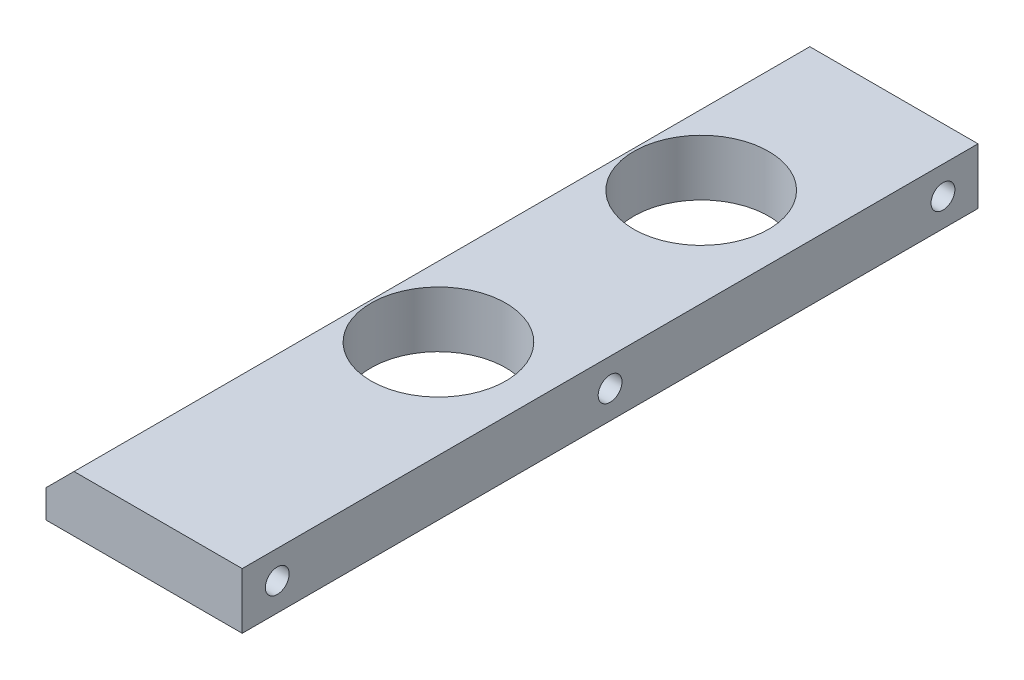
ISO-10303-21;
HEADER;
FILE_DESCRIPTION(('STEP AP214'),'2;1');
FILE_NAME('part.step','',(''),(''),'','','');
FILE_SCHEMA(('AUTOMOTIVE_DESIGN { 1 0 10303 214 1 1 1 1 }'));
ENDSEC;
DATA;
#1=APPLICATION_CONTEXT('core data for automotive mechanical design processes');
#2=APPLICATION_PROTOCOL_DEFINITION('international standard','automotive_design',2000,#1);
#3=PRODUCT_CONTEXT('',#1,'mechanical');
#4=PRODUCT('Part','Part','',(#3));
#5=PRODUCT_RELATED_PRODUCT_CATEGORY('part','',(#4));
#6=PRODUCT_DEFINITION_FORMATION('','',#4);
#7=PRODUCT_DEFINITION_CONTEXT('part definition',#1,'design');
#8=PRODUCT_DEFINITION('design','',#6,#7);
#9=PRODUCT_DEFINITION_SHAPE('','',#8);
#10=(LENGTH_UNIT() NAMED_UNIT(*) SI_UNIT(.MILLI.,.METRE.));
#11=(NAMED_UNIT(*) PLANE_ANGLE_UNIT() SI_UNIT($,.RADIAN.));
#12=(NAMED_UNIT(*) SI_UNIT($,.STERADIAN.) SOLID_ANGLE_UNIT());
#13=UNCERTAINTY_MEASURE_WITH_UNIT(LENGTH_MEASURE(1.E-05),#10,'distance_accuracy_value','');
#14=(GEOMETRIC_REPRESENTATION_CONTEXT(3) GLOBAL_UNCERTAINTY_ASSIGNED_CONTEXT((#13)) GLOBAL_UNIT_ASSIGNED_CONTEXT((#10,
#11,#12)) REPRESENTATION_CONTEXT('',''));
#15=CARTESIAN_POINT('',(0.,0.,0.));
#16=DIRECTION('',(0.,0.,1.));
#17=DIRECTION('',(1.,0.,0.));
#18=AXIS2_PLACEMENT_3D('',#15,#16,#17);
#19=CARTESIAN_POINT('',(13.0000000000337,8.00000000000001,95.));
#20=DIRECTION('',(1.,0.,0.));
#21=DIRECTION('',(0.,1.,0.));
#22=AXIS2_PLACEMENT_3D('',#19,#20,#21);
#23=CONICAL_SURFACE('',#22,3.3999999999719,1.02974425866659);
#24=CARTESIAN_POINT('',(10.9570738953551,8.00000000006662,95.));
#25=VERTEX_POINT('',#24);
#26=VERTEX_LOOP('',#25);
#27=FACE_BOUND('',#26,.T.);
#28=CARTESIAN_POINT('',(13.,8.00000000000001,95.));
#29=DIRECTION('',(1.,0.,0.));
#30=DIRECTION('',(0.,0.,-1.));
#31=AXIS2_PLACEMENT_3D('',#28,#29,#30);
#32=CIRCLE('',#31,3.4);
#33=CARTESIAN_POINT('',(13.,8.00000000000001,91.6));
#34=VERTEX_POINT('',#33);
#35=EDGE_CURVE('E92',#34,#34,#32,.T.);
#36=ORIENTED_EDGE('',*,*,#35,.T.);
#37=EDGE_LOOP('',(#36));
#38=FACE_BOUND('',#37,.T.);
#39=ADVANCED_FACE('F16',(#27,#38),#23,.F.);
#40=CARTESIAN_POINT('',(12.9999999998631,8.00000000000001,0.));
#41=DIRECTION('',(1.,0.,0.));
#42=DIRECTION('',(0.,1.,0.));
#43=AXIS2_PLACEMENT_3D('',#40,#41,#42);
#44=CONICAL_SURFACE('',#43,3.39999999982865,1.02974425858268);
#45=CARTESIAN_POINT('',(10.9570738951561,8.00000000018031,0.));
#46=VERTEX_POINT('',#45);
#47=VERTEX_LOOP('',#46);
#48=FACE_BOUND('',#47,.T.);
#49=CARTESIAN_POINT('',(13.,8.00000000000001,0.));
#50=DIRECTION('',(1.,0.,0.));
#51=DIRECTION('',(0.,0.,-1.));
#52=AXIS2_PLACEMENT_3D('',#49,#50,#51);
#53=CIRCLE('',#52,3.4);
#54=CARTESIAN_POINT('',(13.,8.00000000000001,-3.4));
#55=VERTEX_POINT('',#54);
#56=EDGE_CURVE('E94',#55,#55,#53,.T.);
#57=ORIENTED_EDGE('',*,*,#56,.T.);
#58=EDGE_LOOP('',(#57));
#59=FACE_BOUND('',#58,.T.);
#60=ADVANCED_FACE('F89',(#48,#59),#44,.F.);
#61=CARTESIAN_POINT('',(13.0000000000337,8.00000000000001,-95.));
#62=DIRECTION('',(1.,0.,0.));
#63=DIRECTION('',(0.,1.,0.));
#64=AXIS2_PLACEMENT_3D('',#61,#62,#63);
#65=CONICAL_SURFACE('',#64,3.39999999996962,1.02974425866599);
#66=CARTESIAN_POINT('',(10.9570738953266,8.00000000000978,-95.));
#67=VERTEX_POINT('',#66);
#68=VERTEX_LOOP('',#67);
#69=FACE_BOUND('',#68,.T.);
#70=CARTESIAN_POINT('',(13.,8.00000000000001,-95.));
#71=DIRECTION('',(1.,0.,0.));
#72=DIRECTION('',(0.,0.,-1.));
#73=AXIS2_PLACEMENT_3D('',#70,#71,#72);
#74=CIRCLE('',#73,3.4);
#75=CARTESIAN_POINT('',(13.,8.00000000000001,-98.4));
#76=VERTEX_POINT('',#75);
#77=EDGE_CURVE('E97',#76,#76,#74,.T.);
#78=ORIENTED_EDGE('',*,*,#77,.T.);
#79=EDGE_LOOP('',(#78));
#80=FACE_BOUND('',#79,.T.);
#81=ADVANCED_FACE('F204',(#69,#80),#65,.F.);
#82=CARTESIAN_POINT('',(10.1049275901,8.00000000000001,95.));
#83=DIRECTION('',(1.,0.,0.));
#84=DIRECTION('',(0.,0.,-1.));
#85=AXIS2_PLACEMENT_3D('',#82,#83,#84);
#86=CYLINDRICAL_SURFACE('',#85,3.4);
#87=ORIENTED_EDGE('',*,*,#35,.F.);
#88=EDGE_LOOP('',(#87));
#89=FACE_BOUND('',#88,.T.);
#90=CARTESIAN_POINT('',(28.,8.00000000000001,95.));
#91=DIRECTION('',(1.,0.,0.));
#92=DIRECTION('',(0.,0.,-1.));
#93=AXIS2_PLACEMENT_3D('',#90,#91,#92);
#94=CIRCLE('',#93,3.4);
#95=CARTESIAN_POINT('',(28.,8.00000000000001,91.6));
#96=VERTEX_POINT('',#95);
#97=EDGE_CURVE('E19',#96,#96,#94,.F.);
#98=ORIENTED_EDGE('',*,*,#97,.F.);
#99=EDGE_LOOP('',(#98));
#100=FACE_BOUND('',#99,.T.);
#101=ADVANCED_FACE('F345',(#89,#100),#86,.F.);
#102=CARTESIAN_POINT('',(10.1049275901,8.00000000000001,0.));
#103=DIRECTION('',(1.,0.,0.));
#104=DIRECTION('',(0.,0.,-1.));
#105=AXIS2_PLACEMENT_3D('',#102,#103,#104);
#106=CYLINDRICAL_SURFACE('',#105,3.4);
#107=ORIENTED_EDGE('',*,*,#56,.F.);
#108=EDGE_LOOP('',(#107));
#109=FACE_BOUND('',#108,.T.);
#110=CARTESIAN_POINT('',(28.,8.00000000000001,0.));
#111=DIRECTION('',(1.,0.,0.));
#112=DIRECTION('',(0.,0.,-1.));
#113=AXIS2_PLACEMENT_3D('',#110,#111,#112);
#114=CIRCLE('',#113,3.4);
#115=CARTESIAN_POINT('',(28.,8.00000000000001,-3.4));
#116=VERTEX_POINT('',#115);
#117=EDGE_CURVE('E127',#116,#116,#114,.F.);
#118=ORIENTED_EDGE('',*,*,#117,.F.);
#119=EDGE_LOOP('',(#118));
#120=FACE_BOUND('',#119,.T.);
#121=ADVANCED_FACE('F210',(#109,#120),#106,.F.);
#122=CARTESIAN_POINT('',(10.1049275901,8.00000000000001,-95.));
#123=DIRECTION('',(1.,0.,0.));
#124=DIRECTION('',(0.,0.,-1.));
#125=AXIS2_PLACEMENT_3D('',#122,#123,#124);
#126=CYLINDRICAL_SURFACE('',#125,3.4);
#127=ORIENTED_EDGE('',*,*,#77,.F.);
#128=EDGE_LOOP('',(#127));
#129=FACE_BOUND('',#128,.T.);
#130=CARTESIAN_POINT('',(28.,8.00000000000001,-95.));
#131=DIRECTION('',(1.,0.,0.));
#132=DIRECTION('',(0.,0.,-1.));
#133=AXIS2_PLACEMENT_3D('',#130,#131,#132);
#134=CIRCLE('',#133,3.4);
#135=CARTESIAN_POINT('',(28.,8.00000000000001,-98.4));
#136=VERTEX_POINT('',#135);
#137=EDGE_CURVE('E124',#136,#136,#134,.F.);
#138=ORIENTED_EDGE('',*,*,#137,.F.);
#139=EDGE_LOOP('',(#138));
#140=FACE_BOUND('',#139,.T.);
#141=ADVANCED_FACE('F206',(#129,#140),#126,.F.);
#142=CARTESIAN_POINT('',(-24.,12.,0.));
#143=DIRECTION('',(-0.707106781186548,0.707106781186548,0.));
#144=DIRECTION('',(-0.707106781186548,-0.707106781186548,0.));
#145=AXIS2_PLACEMENT_3D('',#142,#143,#144);
#146=PLANE('',#145);
#147=DIRECTION('',(0.,0.,1.));
#148=VECTOR('',#147,1.);
#149=CARTESIAN_POINT('',(-28.,8.00000000000001,-105.));
#150=LINE('',#149,#148);
#151=CARTESIAN_POINT('',(-28.,8.00000000000001,105.));
#152=VERTEX_POINT('',#151);
#153=CARTESIAN_POINT('',(-28.,8.00000000000001,-105.));
#154=VERTEX_POINT('',#153);
#155=EDGE_CURVE('E153',#152,#154,#150,.F.);
#156=ORIENTED_EDGE('',*,*,#155,.F.);
#157=DIRECTION('',(-0.707106781186548,-0.707106781186548,0.));
#158=VECTOR('',#157,1.);
#159=CARTESIAN_POINT('',(-20.,16.,105.));
#160=LINE('',#159,#158);
#161=CARTESIAN_POINT('',(-20.,16.,105.));
#162=VERTEX_POINT('',#161);
#163=EDGE_CURVE('E141',#162,#152,#160,.T.);
#164=ORIENTED_EDGE('',*,*,#163,.F.);
#165=DIRECTION('',(0.,0.,1.));
#166=VECTOR('',#165,1.);
#167=CARTESIAN_POINT('',(-20.,16.,0.));
#168=LINE('',#167,#166);
#169=CARTESIAN_POINT('',(-20.,16.,-105.));
#170=VERTEX_POINT('',#169);
#171=EDGE_CURVE('E200',#170,#162,#168,.T.);
#172=ORIENTED_EDGE('',*,*,#171,.F.);
#173=DIRECTION('',(0.707106781186548,0.707106781186548,0.));
#174=VECTOR('',#173,1.);
#175=CARTESIAN_POINT('',(-28.,8.00000000000001,-105.));
#176=LINE('',#175,#174);
#177=EDGE_CURVE('E123',#154,#170,#176,.T.);
#178=ORIENTED_EDGE('',*,*,#177,.F.);
#179=EDGE_LOOP('',(#156,#164,#172,#178));
#180=FACE_BOUND('',#179,.T.);
#181=ADVANCED_FACE('F209',(#180),#146,.T.);
#182=CARTESIAN_POINT('',(0.,16.,0.));
#183=DIRECTION('',(0.,1.,0.));
#184=DIRECTION('',(0.,0.,1.));
#185=AXIS2_PLACEMENT_3D('',#182,#183,#184);
#186=PLANE('',#185);
#187=CARTESIAN_POINT('',(0.,16.,21.));
#188=DIRECTION('',(0.,1.,0.));
#189=DIRECTION('',(0.,0.,1.));
#190=AXIS2_PLACEMENT_3D('',#187,#188,#189);
#191=CIRCLE('',#190,19.25);
#192=CARTESIAN_POINT('',(0.,16.,40.25));
#193=VERTEX_POINT('',#192);
#194=EDGE_CURVE('E116',#193,#193,#191,.F.);
#195=ORIENTED_EDGE('',*,*,#194,.T.);
#196=EDGE_LOOP('',(#195));
#197=FACE_BOUND('',#196,.T.);
#198=CARTESIAN_POINT('',(0.,16.,-54.));
#199=DIRECTION('',(0.,1.,0.));
#200=DIRECTION('',(0.,0.,1.));
#201=AXIS2_PLACEMENT_3D('',#198,#199,#200);
#202=CIRCLE('',#201,19.25);
#203=CARTESIAN_POINT('',(0.,16.,-34.75));
#204=VERTEX_POINT('',#203);
#205=EDGE_CURVE('E120',#204,#204,#202,.F.);
#206=ORIENTED_EDGE('',*,*,#205,.T.);
#207=EDGE_LOOP('',(#206));
#208=FACE_BOUND('',#207,.T.);
#209=DIRECTION('',(-1.,0.,0.));
#210=VECTOR('',#209,1.);
#211=CARTESIAN_POINT('',(28.,16.,-105.));
#212=LINE('',#211,#210);
#213=CARTESIAN_POINT('',(28.,16.,-105.));
#214=VERTEX_POINT('',#213);
#215=EDGE_CURVE('E126',#170,#214,#212,.F.);
#216=ORIENTED_EDGE('',*,*,#215,.F.);
#217=ORIENTED_EDGE('',*,*,#171,.T.);
#218=DIRECTION('',(1.,0.,0.));
#219=VECTOR('',#218,1.);
#220=CARTESIAN_POINT('',(-28.,16.,105.));
#221=LINE('',#220,#219);
#222=CARTESIAN_POINT('',(28.,16.,105.));
#223=VERTEX_POINT('',#222);
#224=EDGE_CURVE('E148',#223,#162,#221,.F.);
#225=ORIENTED_EDGE('',*,*,#224,.F.);
#226=DIRECTION('',(0.,0.,-1.));
#227=VECTOR('',#226,1.);
#228=CARTESIAN_POINT('',(28.,16.,105.));
#229=LINE('',#228,#227);
#230=EDGE_CURVE('E135',#214,#223,#229,.F.);
#231=ORIENTED_EDGE('',*,*,#230,.F.);
#232=EDGE_LOOP('',(#216,#217,#225,#231));
#233=FACE_BOUND('',#232,.T.);
#234=ADVANCED_FACE('F287',(#197,#208,#233),#186,.T.);
#235=CARTESIAN_POINT('',(-14.3,11.0000000000241,-78.7));
#236=DIRECTION('',(0.,-1.,0.));
#237=DIRECTION('',(0.,0.,-1.));
#238=AXIS2_PLACEMENT_3D('',#235,#236,#237);
#239=CONICAL_SURFACE('',#238,2.49999999997154,1.02974425866932);
#240=CARTESIAN_POINT('',(-14.3,11.,-78.7));
#241=DIRECTION('',(0.,-1.,0.));
#242=DIRECTION('',(0.,0.,-1.));
#243=AXIS2_PLACEMENT_3D('',#240,#241,#242);
#244=CIRCLE('',#243,2.5);
#245=CARTESIAN_POINT('',(-14.3,11.,-81.2));
#246=VERTEX_POINT('',#245);
#247=EDGE_CURVE('E119',#246,#246,#244,.T.);
#248=ORIENTED_EDGE('',*,*,#247,.T.);
#249=EDGE_LOOP('',(#248));
#250=FACE_BOUND('',#249,.T.);
#251=CARTESIAN_POINT('',(-14.2999999999631,12.5021515475225,-78.7));
#252=VERTEX_POINT('',#251);
#253=VERTEX_LOOP('',#252);
#254=FACE_BOUND('',#253,.T.);
#255=ADVANCED_FACE('F327',(#250,#254),#239,.F.);
#256=CARTESIAN_POINT('',(-14.3,11.0000000000809,-3.69999999999999));
#257=DIRECTION('',(0.,-1.,0.));
#258=DIRECTION('',(0.,0.,-1.));
#259=AXIS2_PLACEMENT_3D('',#256,#257,#258);
#260=CONICAL_SURFACE('',#259,2.50000000003529,1.02974425868861);
#261=CARTESIAN_POINT('',(-16.800000000017,11.0000000000241,-3.69999999999999));
#262=CARTESIAN_POINT('',(-16.6958333333341,11.0625896478075,-3.69999999999947));
#263=CARTESIAN_POINT('',(-16.5916666666701,11.1251792956221,-3.69999999999901));
#264=CARTESIAN_POINT('',(-16.3833333333419,11.2503585912702,-3.69999999999822));
#265=CARTESIAN_POINT('',(-16.2791666666778,11.3129482391038,-3.69999999999789));
#266=CARTESIAN_POINT('',(-16.0708333333372,11.4381275347313,-3.69999999999736));
#267=CARTESIAN_POINT('',(-15.9666666666607,11.5007171825252,-3.69999999999716));
#268=CARTESIAN_POINT('',(-15.7583333333239,11.625896478159,-3.6999999999969));
#269=CARTESIAN_POINT('',(-15.6541666666637,11.6884861259988,-3.69999999999683));
#270=CARTESIAN_POINT('',(-15.4458333333241,11.813665421628,-3.69999999999683));
#271=CARTESIAN_POINT('',(-15.3416666666448,11.8762550694174,-3.6999999999969));
#272=CARTESIAN_POINT('',(-15.1333333333265,12.0014343650503,-3.69999999999716));
#273=CARTESIAN_POINT('',(-15.0291666666874,12.0640240128939,-3.69999999999736));
#274=CARTESIAN_POINT('',(-14.8208333333728,12.1892033085332,-3.69999999999789));
#275=CARTESIAN_POINT('',(-14.7166666666974,12.2517929563288,-3.69999999999822));
#276=CARTESIAN_POINT('',(-14.5083333333464,12.3769722519391,-3.69999999999901));
#277=CARTESIAN_POINT('',(-14.4041666666709,12.4395618997536,-3.69999999999947));
#278=CARTESIAN_POINT('',(-14.3000000000193,12.5021515476078,-3.69999999999999));
#279=B_SPLINE_CURVE_WITH_KNOTS('',3,(#261,#262,#263,#264,#265,#266,#267,#268,#269,#270,#271,
#272,#273,#274,#275,#276,#277,#278),.UNSPECIFIED.,.F.,.F.,(4,2,2,2,2,2,2,2,4),(0.,
0.364572936621953,0.729145873273182,1.09371880989513,1.45829174654636,1.82286468316832,
2.18743761977082,2.55201055639277,2.916583493044),.UNSPECIFIED.);
#280=CARTESIAN_POINT('',(-16.8000000000043,11.000000000006,-3.69999999999999));
#281=VERTEX_POINT('',#280);
#282=CARTESIAN_POINT('',(-14.3,12.5021515476078,-3.69999999999999));
#283=VERTEX_POINT('',#282);
#284=EDGE_CURVE('E155',#281,#283,#279,.T.);
#285=ORIENTED_EDGE('',*,*,#284,.T.);
#286=CARTESIAN_POINT('',(-14.2999999999807,12.5021515476078,-3.69999999999999));
#287=CARTESIAN_POINT('',(-14.195833333329,12.4395618997536,-3.69999999999947));
#288=CARTESIAN_POINT('',(-14.0916666666535,12.3769722519391,-3.69999999999901));
#289=CARTESIAN_POINT('',(-13.8833333333026,12.2517929563288,-3.69999999999822));
#290=CARTESIAN_POINT('',(-13.7791666666271,12.1892033085332,-3.69999999999789));
#291=CARTESIAN_POINT('',(-13.5708333333126,12.0640240128939,-3.69999999999736));
#292=CARTESIAN_POINT('',(-13.4666666666735,12.0014343650503,-3.69999999999716));
#293=CARTESIAN_POINT('',(-13.2583333333551,11.8762550694174,-3.6999999999969));
#294=CARTESIAN_POINT('',(-13.1541666666759,11.813665421628,-3.69999999999683));
#295=CARTESIAN_POINT('',(-12.9458333333363,11.6884861259988,-3.69999999999683));
#296=CARTESIAN_POINT('',(-12.841666666676,11.625896478159,-3.6999999999969));
#297=CARTESIAN_POINT('',(-12.6333333333392,11.5007171825252,-3.69999999999716));
#298=CARTESIAN_POINT('',(-12.5291666666627,11.4381275347313,-3.69999999999736));
#299=CARTESIAN_POINT('',(-12.3208333333221,11.3129482391038,-3.69999999999789));
#300=CARTESIAN_POINT('',(-12.2166666666581,11.2503585912702,-3.69999999999822));
#301=CARTESIAN_POINT('',(-12.0083333333299,11.1251792956221,-3.69999999999901));
#302=CARTESIAN_POINT('',(-11.9041666666658,11.0625896478075,-3.69999999999947));
#303=CARTESIAN_POINT('',(-11.799999999983,11.0000000000241,-3.7));
#304=B_SPLINE_CURVE_WITH_KNOTS('',3,(#286,#287,#288,#289,#290,#291,#292,#293,#294,#295,#296,
#297,#298,#299,#300,#301,#302,#303),.UNSPECIFIED.,.F.,.F.,(4,2,2,2,2,2,2,2,4),(0.,
0.364572936651229,0.729145873273182,1.09371880987569,1.45829174649764,1.82286468314887,
2.18743761977082,2.55201055642205,2.916583493044),.UNSPECIFIED.);
#305=CARTESIAN_POINT('',(-11.7999999999958,11.000000000006,-3.69999999999999));
#306=VERTEX_POINT('',#305);
#307=EDGE_CURVE('E175',#283,#306,#304,.T.);
#308=ORIENTED_EDGE('',*,*,#307,.T.);
#309=CARTESIAN_POINT('',(-14.3,11.,-3.69999999999999));
#310=DIRECTION('',(0.,-1.,0.));
#311=DIRECTION('',(0.,0.,-1.));
#312=AXIS2_PLACEMENT_3D('',#309,#310,#311);
#313=CIRCLE('',#312,2.5);
#314=EDGE_CURVE('E164',#306,#281,#313,.T.);
#315=ORIENTED_EDGE('',*,*,#314,.T.);
#316=EDGE_LOOP('',(#285,#308,#315));
#317=FACE_BOUND('',#316,.T.);
#318=ADVANCED_FACE('F309',(#317),#260,.F.);
#319=CARTESIAN_POINT('',(-14.3,11.0000000000241,-3.69999999999999));
#320=DIRECTION('',(0.,-1.,0.));
#321=DIRECTION('',(0.,0.,-1.));
#322=AXIS2_PLACEMENT_3D('',#319,#320,#321);
#323=CONICAL_SURFACE('',#322,2.50000000001701,1.0297442586719);
#324=CARTESIAN_POINT('',(-14.3,11.,-3.69999999999999));
#325=DIRECTION('',(0.,-1.,0.));
#326=DIRECTION('',(0.,0.,-1.));
#327=AXIS2_PLACEMENT_3D('',#324,#325,#326);
#328=CIRCLE('',#327,2.5);
#329=EDGE_CURVE('E163',#281,#306,#328,.T.);
#330=ORIENTED_EDGE('',*,*,#329,.T.);
#331=ORIENTED_EDGE('',*,*,#307,.F.);
#332=ORIENTED_EDGE('',*,*,#284,.F.);
#333=EDGE_LOOP('',(#330,#331,#332));
#334=FACE_BOUND('',#333,.T.);
#335=ADVANCED_FACE('F183',(#334),#323,.F.);
#336=CARTESIAN_POINT('',(14.3,10.9999999999673,-29.3));
#337=DIRECTION('',(0.,-1.,0.));
#338=DIRECTION('',(0.,0.,-1.));
#339=AXIS2_PLACEMENT_3D('',#336,#337,#338);
#340=CONICAL_SURFACE('',#339,2.50000000001983,1.02974425867857);
#341=CARTESIAN_POINT('',(14.3,11.,-29.3));
#342=DIRECTION('',(0.,-1.,0.));
#343=DIRECTION('',(0.,0.,-1.));
#344=AXIS2_PLACEMENT_3D('',#341,#342,#343);
#345=CIRCLE('',#344,2.5);
#346=CARTESIAN_POINT('',(14.3,11.,-31.8));
#347=VERTEX_POINT('',#346);
#348=EDGE_CURVE('E160',#347,#347,#345,.T.);
#349=ORIENTED_EDGE('',*,*,#348,.T.);
#350=EDGE_LOOP('',(#349));
#351=FACE_BOUND('',#350,.T.);
#352=CARTESIAN_POINT('',(14.30000000002,12.502151547551,-29.3));
#353=VERTEX_POINT('',#352);
#354=VERTEX_LOOP('',#353);
#355=FACE_BOUND('',#354,.T.);
#356=ADVANCED_FACE('F181',(#351,#355),#340,.F.);
#357=CARTESIAN_POINT('',(14.3,11.0000000000809,45.6999999999998));
#358=DIRECTION('',(0.,-1.,0.));
#359=DIRECTION('',(0.,0.,-1.));
#360=AXIS2_PLACEMENT_3D('',#357,#358,#359);
#361=CONICAL_SURFACE('',#360,2.49999999978108,1.02974425852182);
#362=CARTESIAN_POINT('',(14.3,11.,45.6999999999998));
#363=DIRECTION('',(0.,-1.,0.));
#364=DIRECTION('',(0.,0.,-1.));
#365=AXIS2_PLACEMENT_3D('',#362,#363,#364);
#366=CIRCLE('',#365,2.5);
#367=CARTESIAN_POINT('',(14.3,11.,43.1999999999998));
#368=VERTEX_POINT('',#367);
#369=EDGE_CURVE('E156',#368,#368,#366,.T.);
#370=ORIENTED_EDGE('',*,*,#369,.T.);
#371=EDGE_LOOP('',(#370));
#372=FACE_BOUND('',#371,.T.);
#373=CARTESIAN_POINT('',(14.3000000002473,12.5021515476362,45.6999999999998));
#374=VERTEX_POINT('',#373);
#375=VERTEX_LOOP('',#374);
#376=FACE_BOUND('',#375,.T.);
#377=ADVANCED_FACE('F293',(#372,#376),#361,.F.);
#378=CARTESIAN_POINT('',(-28.,0.,-105.));
#379=DIRECTION('',(-1.,0.,0.));
#380=DIRECTION('',(0.,0.,1.));
#381=AXIS2_PLACEMENT_3D('',#378,#379,#380);
#382=PLANE('',#381);
#383=DIRECTION('',(0.,1.,0.));
#384=VECTOR('',#383,1.);
#385=CARTESIAN_POINT('',(-28.,0.,105.));
#386=LINE('',#385,#384);
#387=CARTESIAN_POINT('',(-28.,0.,105.));
#388=VERTEX_POINT('',#387);
#389=EDGE_CURVE('E151',#152,#388,#386,.F.);
#390=ORIENTED_EDGE('',*,*,#389,.F.);
#391=ORIENTED_EDGE('',*,*,#155,.T.);
#392=DIRECTION('',(0.,1.,0.));
#393=VECTOR('',#392,1.);
#394=CARTESIAN_POINT('',(-28.,0.,-105.));
#395=LINE('',#394,#393);
#396=CARTESIAN_POINT('',(-28.,0.,-105.));
#397=VERTEX_POINT('',#396);
#398=EDGE_CURVE('E280',#397,#154,#395,.T.);
#399=ORIENTED_EDGE('',*,*,#398,.F.);
#400=DIRECTION('',(0.,0.,1.));
#401=VECTOR('',#400,1.);
#402=CARTESIAN_POINT('',(-28.,0.,0.));
#403=LINE('',#402,#401);
#404=EDGE_CURVE('E159',#397,#388,#403,.T.);
#405=ORIENTED_EDGE('',*,*,#404,.T.);
#406=EDGE_LOOP('',(#390,#391,#399,#405));
#407=FACE_BOUND('',#406,.T.);
#408=ADVANCED_FACE('F226',(#407),#382,.T.);
#409=CARTESIAN_POINT('',(-28.,0.,105.));
#410=DIRECTION('',(0.,0.,1.));
#411=DIRECTION('',(1.,0.,0.));
#412=AXIS2_PLACEMENT_3D('',#409,#410,#411);
#413=PLANE('',#412);
#414=ORIENTED_EDGE('',*,*,#224,.T.);
#415=ORIENTED_EDGE('',*,*,#163,.T.);
#416=ORIENTED_EDGE('',*,*,#389,.T.);
#417=DIRECTION('',(1.,0.,0.));
#418=VECTOR('',#417,1.);
#419=CARTESIAN_POINT('',(0.,0.,105.));
#420=LINE('',#419,#418);
#421=CARTESIAN_POINT('',(28.,0.,105.));
#422=VERTEX_POINT('',#421);
#423=EDGE_CURVE('E270',#388,#422,#420,.T.);
#424=ORIENTED_EDGE('',*,*,#423,.T.);
#425=DIRECTION('',(0.,1.,0.));
#426=VECTOR('',#425,1.);
#427=CARTESIAN_POINT('',(28.,0.,105.));
#428=LINE('',#427,#426);
#429=EDGE_CURVE('E132',#223,#422,#428,.F.);
#430=ORIENTED_EDGE('',*,*,#429,.F.);
#431=EDGE_LOOP('',(#414,#415,#416,#424,#430));
#432=FACE_BOUND('',#431,.T.);
#433=ADVANCED_FACE('F217',(#432),#413,.T.);
#434=CARTESIAN_POINT('',(28.,0.,105.));
#435=DIRECTION('',(1.,0.,0.));
#436=DIRECTION('',(0.,0.,-1.));
#437=AXIS2_PLACEMENT_3D('',#434,#435,#436);
#438=PLANE('',#437);
#439=ORIENTED_EDGE('',*,*,#137,.T.);
#440=EDGE_LOOP('',(#439));
#441=FACE_BOUND('',#440,.T.);
#442=ORIENTED_EDGE('',*,*,#117,.T.);
#443=EDGE_LOOP('',(#442));
#444=FACE_BOUND('',#443,.T.);
#445=ORIENTED_EDGE('',*,*,#97,.T.);
#446=EDGE_LOOP('',(#445));
#447=FACE_BOUND('',#446,.T.);
#448=ORIENTED_EDGE('',*,*,#429,.T.);
#449=DIRECTION('',(0.,0.,1.));
#450=VECTOR('',#449,1.);
#451=CARTESIAN_POINT('',(28.,0.,0.));
#452=LINE('',#451,#450);
#453=CARTESIAN_POINT('',(28.,0.,-105.));
#454=VERTEX_POINT('',#453);
#455=EDGE_CURVE('E268',#422,#454,#452,.F.);
#456=ORIENTED_EDGE('',*,*,#455,.T.);
#457=DIRECTION('',(0.,1.,0.));
#458=VECTOR('',#457,1.);
#459=CARTESIAN_POINT('',(28.,0.,-105.));
#460=LINE('',#459,#458);
#461=EDGE_CURVE('E34',#214,#454,#460,.F.);
#462=ORIENTED_EDGE('',*,*,#461,.F.);
#463=ORIENTED_EDGE('',*,*,#230,.T.);
#464=EDGE_LOOP('',(#448,#456,#462,#463));
#465=FACE_BOUND('',#464,.T.);
#466=ADVANCED_FACE('F214',(#441,#444,#447,#465),#438,.T.);
#467=CARTESIAN_POINT('',(28.,0.,-105.));
#468=DIRECTION('',(0.,0.,-1.));
#469=DIRECTION('',(-1.,0.,0.));
#470=AXIS2_PLACEMENT_3D('',#467,#468,#469);
#471=PLANE('',#470);
#472=ORIENTED_EDGE('',*,*,#398,.T.);
#473=ORIENTED_EDGE('',*,*,#177,.T.);
#474=ORIENTED_EDGE('',*,*,#215,.T.);
#475=ORIENTED_EDGE('',*,*,#461,.T.);
#476=DIRECTION('',(1.,0.,0.));
#477=VECTOR('',#476,1.);
#478=CARTESIAN_POINT('',(0.,0.,-105.));
#479=LINE('',#478,#477);
#480=EDGE_CURVE('E115',#454,#397,#479,.F.);
#481=ORIENTED_EDGE('',*,*,#480,.T.);
#482=EDGE_LOOP('',(#472,#473,#474,#475,#481));
#483=FACE_BOUND('',#482,.T.);
#484=ADVANCED_FACE('F216',(#483),#471,.T.);
#485=CARTESIAN_POINT('',(0.,0.,-54.));
#486=DIRECTION('',(0.,1.,0.));
#487=DIRECTION('',(0.,0.,1.));
#488=AXIS2_PLACEMENT_3D('',#485,#486,#487);
#489=CYLINDRICAL_SURFACE('',#488,19.25);
#490=ORIENTED_EDGE('',*,*,#205,.F.);
#491=EDGE_LOOP('',(#490));
#492=FACE_BOUND('',#491,.T.);
#493=CARTESIAN_POINT('',(0.,0.,-54.));
#494=DIRECTION('',(0.,1.,0.));
#495=DIRECTION('',(0.,0.,1.));
#496=AXIS2_PLACEMENT_3D('',#493,#494,#495);
#497=CIRCLE('',#496,19.25);
#498=CARTESIAN_POINT('',(0.,0.,-34.75));
#499=VERTEX_POINT('',#498);
#500=EDGE_CURVE('E112',#499,#499,#497,.F.);
#501=ORIENTED_EDGE('',*,*,#500,.T.);
#502=EDGE_LOOP('',(#501));
#503=FACE_BOUND('',#502,.T.);
#504=ADVANCED_FACE('F224',(#492,#503),#489,.F.);
#505=CARTESIAN_POINT('',(0.,0.,21.));
#506=DIRECTION('',(0.,1.,0.));
#507=DIRECTION('',(0.,0.,1.));
#508=AXIS2_PLACEMENT_3D('',#505,#506,#507);
#509=CYLINDRICAL_SURFACE('',#508,19.25);
#510=ORIENTED_EDGE('',*,*,#194,.F.);
#511=EDGE_LOOP('',(#510));
#512=FACE_BOUND('',#511,.T.);
#513=CARTESIAN_POINT('',(0.,0.,21.));
#514=DIRECTION('',(0.,1.,0.));
#515=DIRECTION('',(0.,0.,1.));
#516=AXIS2_PLACEMENT_3D('',#513,#514,#515);
#517=CIRCLE('',#516,19.25);
#518=CARTESIAN_POINT('',(0.,0.,40.25));
#519=VERTEX_POINT('',#518);
#520=EDGE_CURVE('E109',#519,#519,#517,.F.);
#521=ORIENTED_EDGE('',*,*,#520,.T.);
#522=EDGE_LOOP('',(#521));
#523=FACE_BOUND('',#522,.T.);
#524=ADVANCED_FACE('F253',(#512,#523),#509,.F.);
#525=CARTESIAN_POINT('',(-14.3,13.1272591249,-78.7));
#526=DIRECTION('',(0.,-1.,0.));
#527=DIRECTION('',(0.,0.,-1.));
#528=AXIS2_PLACEMENT_3D('',#525,#526,#527);
#529=CYLINDRICAL_SURFACE('',#528,2.5);
#530=ORIENTED_EDGE('',*,*,#247,.F.);
#531=EDGE_LOOP('',(#530));
#532=FACE_BOUND('',#531,.T.);
#533=CARTESIAN_POINT('',(-14.3,0.,-78.7));
#534=DIRECTION('',(0.,-1.,0.));
#535=DIRECTION('',(0.,0.,-1.));
#536=AXIS2_PLACEMENT_3D('',#533,#534,#535);
#537=CIRCLE('',#536,2.5);
#538=CARTESIAN_POINT('',(-14.3,0.,-81.2));
#539=VERTEX_POINT('',#538);
#540=EDGE_CURVE('E106',#539,#539,#537,.T.);
#541=ORIENTED_EDGE('',*,*,#540,.T.);
#542=EDGE_LOOP('',(#541));
#543=FACE_BOUND('',#542,.T.);
#544=ADVANCED_FACE('F249',(#532,#543),#529,.F.);
#545=CARTESIAN_POINT('',(-14.3,13.1272591249,-3.69999999999999));
#546=DIRECTION('',(0.,-1.,0.));
#547=DIRECTION('',(0.,0.,-1.));
#548=AXIS2_PLACEMENT_3D('',#545,#546,#547);
#549=CYLINDRICAL_SURFACE('',#548,2.5);
#550=ORIENTED_EDGE('',*,*,#329,.F.);
#551=ORIENTED_EDGE('',*,*,#314,.F.);
#552=EDGE_LOOP('',(#550,#551));
#553=FACE_BOUND('',#552,.T.);
#554=CARTESIAN_POINT('',(-14.3,0.,-3.69999999999999));
#555=DIRECTION('',(0.,-1.,0.));
#556=DIRECTION('',(0.,0.,-1.));
#557=AXIS2_PLACEMENT_3D('',#554,#555,#556);
#558=CIRCLE('',#557,2.5);
#559=CARTESIAN_POINT('',(-14.3,0.,-6.2));
#560=VERTEX_POINT('',#559);
#561=EDGE_CURVE('E103',#560,#560,#558,.T.);
#562=ORIENTED_EDGE('',*,*,#561,.T.);
#563=EDGE_LOOP('',(#562));
#564=FACE_BOUND('',#563,.T.);
#565=ADVANCED_FACE('F245',(#553,#564),#549,.F.);
#566=CARTESIAN_POINT('',(14.3,13.1272591249,-29.3));
#567=DIRECTION('',(0.,-1.,0.));
#568=DIRECTION('',(0.,0.,-1.));
#569=AXIS2_PLACEMENT_3D('',#566,#567,#568);
#570=CYLINDRICAL_SURFACE('',#569,2.5);
#571=ORIENTED_EDGE('',*,*,#348,.F.);
#572=EDGE_LOOP('',(#571));
#573=FACE_BOUND('',#572,.T.);
#574=CARTESIAN_POINT('',(14.3,0.,-29.3));
#575=DIRECTION('',(0.,-1.,0.));
#576=DIRECTION('',(0.,0.,-1.));
#577=AXIS2_PLACEMENT_3D('',#574,#575,#576);
#578=CIRCLE('',#577,2.5);
#579=CARTESIAN_POINT('',(14.3,0.,-31.8));
#580=VERTEX_POINT('',#579);
#581=EDGE_CURVE('E25',#580,#580,#578,.T.);
#582=ORIENTED_EDGE('',*,*,#581,.T.);
#583=EDGE_LOOP('',(#582));
#584=FACE_BOUND('',#583,.T.);
#585=ADVANCED_FACE('F237',(#573,#584),#570,.F.);
#586=CARTESIAN_POINT('',(14.3,13.1272591249,45.6999999999998));
#587=DIRECTION('',(0.,-1.,0.));
#588=DIRECTION('',(0.,0.,-1.));
#589=AXIS2_PLACEMENT_3D('',#586,#587,#588);
#590=CYLINDRICAL_SURFACE('',#589,2.5);
#591=ORIENTED_EDGE('',*,*,#369,.F.);
#592=EDGE_LOOP('',(#591));
#593=FACE_BOUND('',#592,.T.);
#594=CARTESIAN_POINT('',(14.3,0.,45.7));
#595=DIRECTION('',(0.,-1.,0.));
#596=DIRECTION('',(0.,0.,-1.));
#597=AXIS2_PLACEMENT_3D('',#594,#595,#596);
#598=CIRCLE('',#597,2.5);
#599=CARTESIAN_POINT('',(14.3,0.,43.2));
#600=VERTEX_POINT('',#599);
#601=EDGE_CURVE('E11',#600,#600,#598,.T.);
#602=ORIENTED_EDGE('',*,*,#601,.T.);
#603=EDGE_LOOP('',(#602));
#604=FACE_BOUND('',#603,.T.);
#605=ADVANCED_FACE('F231',(#593,#604),#590,.F.);
#606=CARTESIAN_POINT('',(0.,0.,0.));
#607=DIRECTION('',(0.,1.,0.));
#608=DIRECTION('',(0.,0.,1.));
#609=AXIS2_PLACEMENT_3D('',#606,#607,#608);
#610=PLANE('',#609);
#611=ORIENTED_EDGE('',*,*,#601,.F.);
#612=EDGE_LOOP('',(#611));
#613=FACE_BOUND('',#612,.T.);
#614=ORIENTED_EDGE('',*,*,#581,.F.);
#615=EDGE_LOOP('',(#614));
#616=FACE_BOUND('',#615,.T.);
#617=ORIENTED_EDGE('',*,*,#561,.F.);
#618=EDGE_LOOP('',(#617));
#619=FACE_BOUND('',#618,.T.);
#620=ORIENTED_EDGE('',*,*,#540,.F.);
#621=EDGE_LOOP('',(#620));
#622=FACE_BOUND('',#621,.T.);
#623=ORIENTED_EDGE('',*,*,#520,.F.);
#624=EDGE_LOOP('',(#623));
#625=FACE_BOUND('',#624,.T.);
#626=ORIENTED_EDGE('',*,*,#500,.F.);
#627=EDGE_LOOP('',(#626));
#628=FACE_BOUND('',#627,.T.);
#629=ORIENTED_EDGE('',*,*,#455,.F.);
#630=ORIENTED_EDGE('',*,*,#423,.F.);
#631=ORIENTED_EDGE('',*,*,#404,.F.);
#632=ORIENTED_EDGE('',*,*,#480,.F.);
#633=EDGE_LOOP('',(#629,#630,#631,#632));
#634=FACE_BOUND('',#633,.T.);
#635=ADVANCED_FACE('F229',(#613,#616,#619,#622,#625,#628,#634),#610,.F.);
#636=CLOSED_SHELL('',(#39,#60,#81,#101,#121,#141,#181,#234,#255,#318,#335,#356,#377,#408,#433,
#466,#484,#504,#524,#544,#565,#585,#605,#635));
#637=MANIFOLD_SOLID_BREP('B1',#636);
#638=ADVANCED_BREP_SHAPE_REPRESENTATION('',(#18,#637),#14);
#639=SHAPE_DEFINITION_REPRESENTATION(#9,#638);
ENDSEC;
END-ISO-10303-21;
